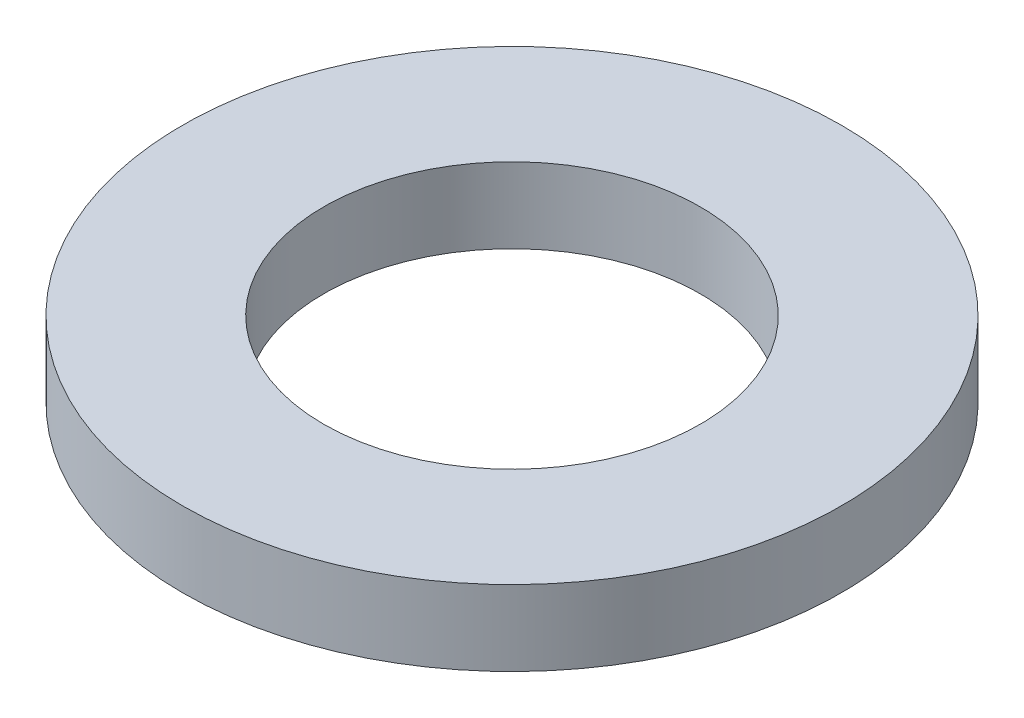
ISO-10303-21;
HEADER;
FILE_DESCRIPTION(('STEP AP214'),'2;1');
FILE_NAME('part.step','',(''),(''),'','','');
FILE_SCHEMA(('AUTOMOTIVE_DESIGN { 1 0 10303 214 1 1 1 1 }'));
ENDSEC;
DATA;
#1=APPLICATION_CONTEXT('core data for automotive mechanical design processes');
#2=APPLICATION_PROTOCOL_DEFINITION('international standard','automotive_design',2000,#1);
#3=PRODUCT_CONTEXT('',#1,'mechanical');
#4=PRODUCT('Part','Part','',(#3));
#5=PRODUCT_RELATED_PRODUCT_CATEGORY('part','',(#4));
#6=PRODUCT_DEFINITION_FORMATION('','',#4);
#7=PRODUCT_DEFINITION_CONTEXT('part definition',#1,'design');
#8=PRODUCT_DEFINITION('design','',#6,#7);
#9=PRODUCT_DEFINITION_SHAPE('','',#8);
#10=(LENGTH_UNIT() NAMED_UNIT(*) SI_UNIT(.MILLI.,.METRE.));
#11=(NAMED_UNIT(*) PLANE_ANGLE_UNIT() SI_UNIT($,.RADIAN.));
#12=(NAMED_UNIT(*) SI_UNIT($,.STERADIAN.) SOLID_ANGLE_UNIT());
#13=UNCERTAINTY_MEASURE_WITH_UNIT(LENGTH_MEASURE(1.E-05),#10,'distance_accuracy_value','');
#14=(GEOMETRIC_REPRESENTATION_CONTEXT(3) GLOBAL_UNCERTAINTY_ASSIGNED_CONTEXT((#13)) GLOBAL_UNIT_ASSIGNED_CONTEXT((#10,
#11,#12)) REPRESENTATION_CONTEXT('',''));
#15=CARTESIAN_POINT('',(0.,0.,0.));
#16=DIRECTION('',(0.,0.,1.));
#17=DIRECTION('',(1.,0.,0.));
#18=AXIS2_PLACEMENT_3D('',#15,#16,#17);
#19=CARTESIAN_POINT('',(0.,1.59999999999999,0.));
#20=DIRECTION('',(0.,1.,0.));
#21=DIRECTION('',(0.,0.,1.00000000000001));
#22=AXIS2_PLACEMENT_3D('',#19,#20,#21);
#23=PLANE('',#22);
#24=CARTESIAN_POINT('',(0.,1.59999999999999,0.));
#25=DIRECTION('',(0.,1.,0.));
#26=DIRECTION('',(0.,0.,1.00000000000001));
#27=AXIS2_PLACEMENT_3D('',#24,#25,#26);
#28=CIRCLE('',#27,7.);
#29=CARTESIAN_POINT('',(0.,1.59999999999999,7.00000000000004));
#30=VERTEX_POINT('',#29);
#31=EDGE_CURVE('E10',#30,#30,#28,.T.);
#32=ORIENTED_EDGE('',*,*,#31,.T.);
#33=EDGE_LOOP('',(#32));
#34=FACE_BOUND('',#33,.T.);
#35=CARTESIAN_POINT('',(0.,1.59999999999999,0.));
#36=DIRECTION('',(0.,1.,0.));
#37=DIRECTION('',(0.,0.,1.00000000000001));
#38=AXIS2_PLACEMENT_3D('',#35,#36,#37);
#39=CIRCLE('',#38,4.);
#40=CARTESIAN_POINT('',(0.,1.59999999999999,4.00000000000002));
#41=VERTEX_POINT('',#40);
#42=EDGE_CURVE('E47',#41,#41,#39,.T.);
#43=ORIENTED_EDGE('',*,*,#42,.F.);
#44=EDGE_LOOP('',(#43));
#45=FACE_BOUND('',#44,.T.);
#46=ADVANCED_FACE('F36',(#34,#45),#23,.T.);
#47=CARTESIAN_POINT('',(0.,0.,0.));
#48=DIRECTION('',(0.,1.,0.));
#49=DIRECTION('',(0.,0.,1.00000000000001));
#50=AXIS2_PLACEMENT_3D('',#47,#48,#49);
#51=PLANE('',#50);
#52=CARTESIAN_POINT('',(0.,0.,0.));
#53=DIRECTION('',(0.,1.,0.));
#54=DIRECTION('',(0.,0.,1.00000000000001));
#55=AXIS2_PLACEMENT_3D('',#52,#53,#54);
#56=CIRCLE('',#55,7.);
#57=CARTESIAN_POINT('',(0.,0.,7.00000000000004));
#58=VERTEX_POINT('',#57);
#59=EDGE_CURVE('E40',#58,#58,#56,.T.);
#60=ORIENTED_EDGE('',*,*,#59,.F.);
#61=EDGE_LOOP('',(#60));
#62=FACE_BOUND('',#61,.T.);
#63=CARTESIAN_POINT('',(0.,0.,0.));
#64=DIRECTION('',(0.,1.,0.));
#65=DIRECTION('',(0.,0.,1.00000000000001));
#66=AXIS2_PLACEMENT_3D('',#63,#64,#65);
#67=CIRCLE('',#66,4.);
#68=CARTESIAN_POINT('',(0.,0.,4.00000000000002));
#69=VERTEX_POINT('',#68);
#70=EDGE_CURVE('E49',#69,#69,#67,.T.);
#71=ORIENTED_EDGE('',*,*,#70,.T.);
#72=EDGE_LOOP('',(#71));
#73=FACE_BOUND('',#72,.T.);
#74=ADVANCED_FACE('F59',(#62,#73),#51,.F.);
#75=CARTESIAN_POINT('',(0.,1.59999999999999,0.));
#76=DIRECTION('',(0.,-1.,0.));
#77=DIRECTION('',(0.,0.,-1.00000000000001));
#78=AXIS2_PLACEMENT_3D('',#75,#76,#77);
#79=CYLINDRICAL_SURFACE('',#78,7.);
#80=ORIENTED_EDGE('',*,*,#31,.F.);
#81=EDGE_LOOP('',(#80));
#82=FACE_BOUND('',#81,.T.);
#83=ORIENTED_EDGE('',*,*,#59,.T.);
#84=EDGE_LOOP('',(#83));
#85=FACE_BOUND('',#84,.T.);
#86=ADVANCED_FACE('F38',(#82,#85),#79,.T.);
#87=CARTESIAN_POINT('',(0.,1.59999999999999,0.));
#88=DIRECTION('',(0.,-1.,0.));
#89=DIRECTION('',(0.,0.,-1.00000000000001));
#90=AXIS2_PLACEMENT_3D('',#87,#88,#89);
#91=CYLINDRICAL_SURFACE('',#90,4.);
#92=ORIENTED_EDGE('',*,*,#42,.T.);
#93=EDGE_LOOP('',(#92));
#94=FACE_BOUND('',#93,.T.);
#95=ORIENTED_EDGE('',*,*,#70,.F.);
#96=EDGE_LOOP('',(#95));
#97=FACE_BOUND('',#96,.T.);
#98=ADVANCED_FACE('F55',(#94,#97),#91,.F.);
#99=CLOSED_SHELL('',(#46,#74,#86,#98));
#100=MANIFOLD_SOLID_BREP('B2',#99);
#101=ADVANCED_BREP_SHAPE_REPRESENTATION('',(#18,#100),#14);
#102=SHAPE_DEFINITION_REPRESENTATION(#9,#101);
ENDSEC;
END-ISO-10303-21;
